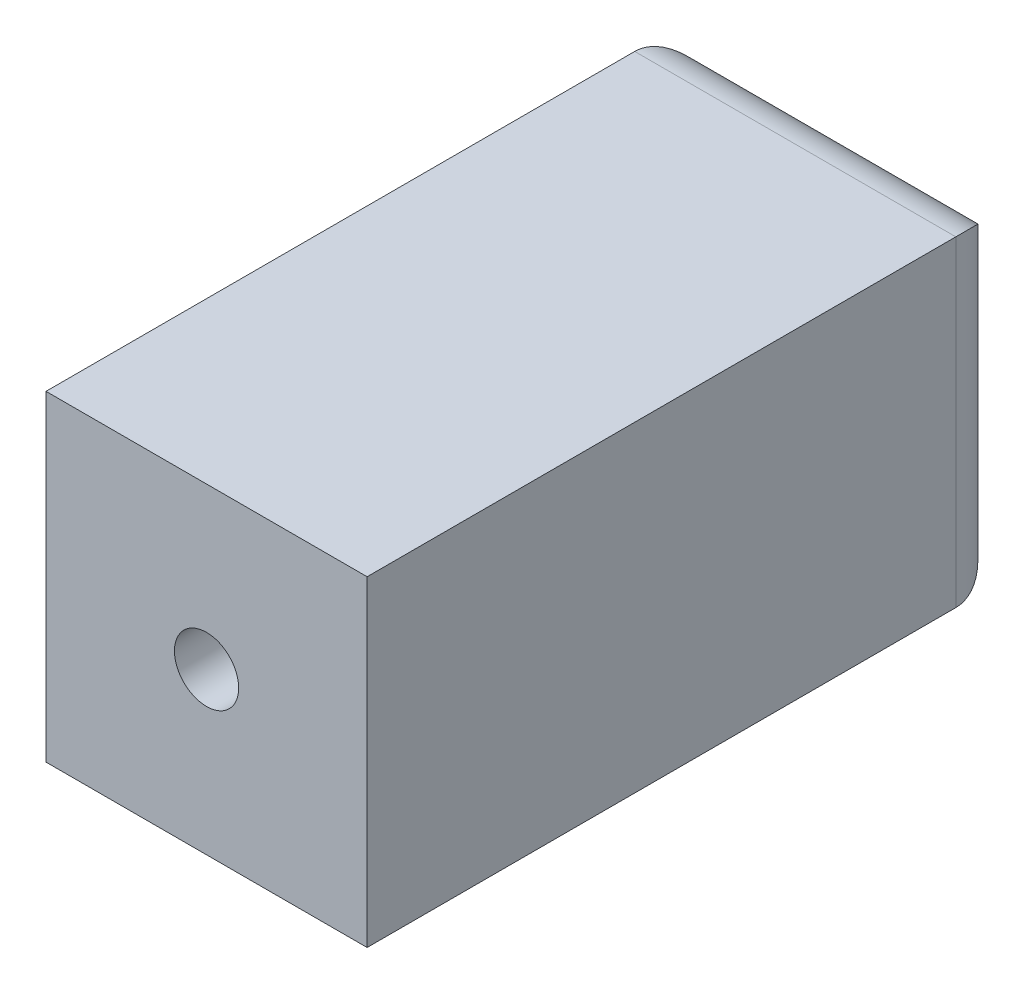
ISO-10303-21;
HEADER;
FILE_DESCRIPTION(('STEP AP214'),'2;1');
FILE_NAME('part.step','',(''),(''),'','','');
FILE_SCHEMA(('AUTOMOTIVE_DESIGN { 1 0 10303 214 1 1 1 1 }'));
ENDSEC;
DATA;
#1=APPLICATION_CONTEXT('core data for automotive mechanical design processes');
#2=APPLICATION_PROTOCOL_DEFINITION('international standard','automotive_design',2000,#1);
#3=PRODUCT_CONTEXT('',#1,'mechanical');
#4=PRODUCT('Part','Part','',(#3));
#5=PRODUCT_RELATED_PRODUCT_CATEGORY('part','',(#4));
#6=PRODUCT_DEFINITION_FORMATION('','',#4);
#7=PRODUCT_DEFINITION_CONTEXT('part definition',#1,'design');
#8=PRODUCT_DEFINITION('design','',#6,#7);
#9=PRODUCT_DEFINITION_SHAPE('','',#8);
#10=(LENGTH_UNIT() NAMED_UNIT(*) SI_UNIT(.MILLI.,.METRE.));
#11=(NAMED_UNIT(*) PLANE_ANGLE_UNIT() SI_UNIT($,.RADIAN.));
#12=(NAMED_UNIT(*) SI_UNIT($,.STERADIAN.) SOLID_ANGLE_UNIT());
#13=UNCERTAINTY_MEASURE_WITH_UNIT(LENGTH_MEASURE(1.E-05),#10,'distance_accuracy_value','');
#14=(GEOMETRIC_REPRESENTATION_CONTEXT(3) GLOBAL_UNCERTAINTY_ASSIGNED_CONTEXT((#13)) GLOBAL_UNIT_ASSIGNED_CONTEXT((#10,
#11,#12)) REPRESENTATION_CONTEXT('',''));
#15=CARTESIAN_POINT('',(0.,0.,0.));
#16=DIRECTION('',(0.,0.,1.));
#17=DIRECTION('',(1.,0.,0.));
#18=AXIS2_PLACEMENT_3D('',#15,#16,#17);
#19=CARTESIAN_POINT('',(7.5,7.5,0.));
#20=DIRECTION('',(0.,0.,-1.));
#21=DIRECTION('',(-1.,0.,0.));
#22=AXIS2_PLACEMENT_3D('',#19,#20,#21);
#23=CYLINDRICAL_SURFACE('',#22,1.49999999999999);
#24=CARTESIAN_POINT('',(7.5,7.5,30.));
#25=DIRECTION('',(0.,0.,-1.));
#26=DIRECTION('',(-1.,0.,0.));
#27=AXIS2_PLACEMENT_3D('',#24,#25,#26);
#28=CIRCLE('',#27,1.49999999999999);
#29=CARTESIAN_POINT('',(6.,7.5,30.));
#30=VERTEX_POINT('',#29);
#31=EDGE_CURVE('E134',#30,#30,#28,.T.);
#32=ORIENTED_EDGE('',*,*,#31,.F.);
#33=EDGE_LOOP('',(#32));
#34=FACE_BOUND('',#33,.T.);
#35=CARTESIAN_POINT('',(7.5,7.5,27.));
#36=DIRECTION('',(0.,0.,-1.));
#37=DIRECTION('',(-1.,0.,0.));
#38=AXIS2_PLACEMENT_3D('',#35,#36,#37);
#39=CIRCLE('',#38,1.49999999999999);
#40=CARTESIAN_POINT('',(6.00000000000001,7.5,27.));
#41=VERTEX_POINT('',#40);
#42=EDGE_CURVE('E39',#41,#41,#39,.F.);
#43=ORIENTED_EDGE('',*,*,#42,.F.);
#44=EDGE_LOOP('',(#43));
#45=FACE_BOUND('',#44,.T.);
#46=ADVANCED_FACE('F35',(#34,#45),#23,.F.);
#47=CARTESIAN_POINT('',(0.,0.,30.));
#48=DIRECTION('',(1.,0.,0.));
#49=DIRECTION('',(0.,1.,0.));
#50=AXIS2_PLACEMENT_3D('',#47,#48,#49);
#51=PLANE('',#50);
#52=DIRECTION('',(0.,0.,-1.));
#53=VECTOR('',#52,1.);
#54=CARTESIAN_POINT('',(0.,15.,30.));
#55=LINE('',#54,#53);
#56=CARTESIAN_POINT('',(0.,15.,30.));
#57=VERTEX_POINT('',#56);
#58=CARTESIAN_POINT('',(0.,15.,2.5));
#59=VERTEX_POINT('',#58);
#60=EDGE_CURVE('E158',#57,#59,#55,.T.);
#61=ORIENTED_EDGE('',*,*,#60,.T.);
#62=DIRECTION('',(0.,-1.,0.));
#63=VECTOR('',#62,1.);
#64=CARTESIAN_POINT('',(0.,0.,2.5));
#65=LINE('',#64,#63);
#66=CARTESIAN_POINT('',(0.,0.,2.5));
#67=VERTEX_POINT('',#66);
#68=EDGE_CURVE('E11',#59,#67,#65,.T.);
#69=ORIENTED_EDGE('',*,*,#68,.T.);
#70=DIRECTION('',(0.,0.,-1.));
#71=VECTOR('',#70,1.);
#72=CARTESIAN_POINT('',(0.,0.,30.));
#73=LINE('',#72,#71);
#74=CARTESIAN_POINT('',(0.,0.,30.));
#75=VERTEX_POINT('',#74);
#76=EDGE_CURVE('E96',#75,#67,#73,.T.);
#77=ORIENTED_EDGE('',*,*,#76,.F.);
#78=DIRECTION('',(0.,-1.,0.));
#79=VECTOR('',#78,1.);
#80=CARTESIAN_POINT('',(0.,0.,30.));
#81=LINE('',#80,#79);
#82=EDGE_CURVE('E102',#57,#75,#81,.T.);
#83=ORIENTED_EDGE('',*,*,#82,.F.);
#84=EDGE_LOOP('',(#61,#69,#77,#83));
#85=FACE_BOUND('',#84,.T.);
#86=ADVANCED_FACE('F111',(#85),#51,.F.);
#87=CARTESIAN_POINT('',(0.,0.,30.));
#88=DIRECTION('',(0.,1.,0.));
#89=DIRECTION('',(0.,0.,1.));
#90=AXIS2_PLACEMENT_3D('',#87,#88,#89);
#91=PLANE('',#90);
#92=ORIENTED_EDGE('',*,*,#76,.T.);
#93=DIRECTION('',(1.,0.,0.));
#94=VECTOR('',#93,1.);
#95=CARTESIAN_POINT('',(15.,0.,2.5));
#96=LINE('',#95,#94);
#97=CARTESIAN_POINT('',(15.,0.,2.5));
#98=VERTEX_POINT('',#97);
#99=EDGE_CURVE('E113',#67,#98,#96,.T.);
#100=ORIENTED_EDGE('',*,*,#99,.T.);
#101=DIRECTION('',(0.,0.,-1.));
#102=VECTOR('',#101,1.);
#103=CARTESIAN_POINT('',(15.,0.,30.));
#104=LINE('',#103,#102);
#105=CARTESIAN_POINT('',(15.,0.,30.));
#106=VERTEX_POINT('',#105);
#107=EDGE_CURVE('E98',#106,#98,#104,.T.);
#108=ORIENTED_EDGE('',*,*,#107,.F.);
#109=DIRECTION('',(1.,0.,0.));
#110=VECTOR('',#109,1.);
#111=CARTESIAN_POINT('',(0.,0.,30.));
#112=LINE('',#111,#110);
#113=EDGE_CURVE('E91',#75,#106,#112,.T.);
#114=ORIENTED_EDGE('',*,*,#113,.F.);
#115=EDGE_LOOP('',(#92,#100,#108,#114));
#116=FACE_BOUND('',#115,.T.);
#117=ADVANCED_FACE('F93',(#116),#91,.F.);
#118=CARTESIAN_POINT('',(15.,0.,30.));
#119=DIRECTION('',(-1.,0.,0.));
#120=DIRECTION('',(0.,-1.,0.));
#121=AXIS2_PLACEMENT_3D('',#118,#119,#120);
#122=PLANE('',#121);
#123=ORIENTED_EDGE('',*,*,#107,.T.);
#124=DIRECTION('',(0.,1.,0.));
#125=VECTOR('',#124,1.);
#126=CARTESIAN_POINT('',(15.,15.,2.5));
#127=LINE('',#126,#125);
#128=CARTESIAN_POINT('',(15.,15.,2.5));
#129=VERTEX_POINT('',#128);
#130=EDGE_CURVE('E59',#98,#129,#127,.T.);
#131=ORIENTED_EDGE('',*,*,#130,.T.);
#132=DIRECTION('',(0.,0.,-1.));
#133=VECTOR('',#132,1.);
#134=CARTESIAN_POINT('',(15.,15.,30.));
#135=LINE('',#134,#133);
#136=CARTESIAN_POINT('',(15.,15.,30.));
#137=VERTEX_POINT('',#136);
#138=EDGE_CURVE('E117',#137,#129,#135,.T.);
#139=ORIENTED_EDGE('',*,*,#138,.F.);
#140=DIRECTION('',(0.,1.,0.));
#141=VECTOR('',#140,1.);
#142=CARTESIAN_POINT('',(15.,0.,30.));
#143=LINE('',#142,#141);
#144=EDGE_CURVE('E101',#106,#137,#143,.T.);
#145=ORIENTED_EDGE('',*,*,#144,.F.);
#146=EDGE_LOOP('',(#123,#131,#139,#145));
#147=FACE_BOUND('',#146,.T.);
#148=ADVANCED_FACE('F156',(#147),#122,.F.);
#149=CARTESIAN_POINT('',(0.,15.,30.));
#150=DIRECTION('',(0.,-1.,0.));
#151=DIRECTION('',(0.,0.,-1.));
#152=AXIS2_PLACEMENT_3D('',#149,#150,#151);
#153=PLANE('',#152);
#154=ORIENTED_EDGE('',*,*,#138,.T.);
#155=DIRECTION('',(-1.,0.,0.));
#156=VECTOR('',#155,1.);
#157=CARTESIAN_POINT('',(0.,15.,2.5));
#158=LINE('',#157,#156);
#159=EDGE_CURVE('E44',#129,#59,#158,.T.);
#160=ORIENTED_EDGE('',*,*,#159,.T.);
#161=ORIENTED_EDGE('',*,*,#60,.F.);
#162=DIRECTION('',(-1.,0.,0.));
#163=VECTOR('',#162,1.);
#164=CARTESIAN_POINT('',(0.,15.,30.));
#165=LINE('',#164,#163);
#166=EDGE_CURVE('E107',#137,#57,#165,.T.);
#167=ORIENTED_EDGE('',*,*,#166,.F.);
#168=EDGE_LOOP('',(#154,#160,#161,#167));
#169=FACE_BOUND('',#168,.T.);
#170=ADVANCED_FACE('F161',(#169),#153,.F.);
#171=CARTESIAN_POINT('',(0.,0.,30.));
#172=DIRECTION('',(0.,0.,-1.));
#173=DIRECTION('',(-1.,0.,0.));
#174=AXIS2_PLACEMENT_3D('',#171,#172,#173);
#175=PLANE('',#174);
#176=ORIENTED_EDGE('',*,*,#31,.T.);
#177=EDGE_LOOP('',(#176));
#178=FACE_BOUND('',#177,.T.);
#179=ORIENTED_EDGE('',*,*,#82,.T.);
#180=ORIENTED_EDGE('',*,*,#113,.T.);
#181=ORIENTED_EDGE('',*,*,#144,.T.);
#182=ORIENTED_EDGE('',*,*,#166,.T.);
#183=EDGE_LOOP('',(#179,#180,#181,#182));
#184=FACE_BOUND('',#183,.T.);
#185=ADVANCED_FACE('F105',(#178,#184),#175,.F.);
#186=CARTESIAN_POINT('',(0.,0.,0.));
#187=DIRECTION('',(0.,0.,-1.));
#188=DIRECTION('',(-1.,0.,0.));
#189=AXIS2_PLACEMENT_3D('',#186,#187,#188);
#190=PLANE('',#189);
#191=CARTESIAN_POINT('',(7.5,7.5,0.));
#192=DIRECTION('',(0.,0.,-1.));
#193=DIRECTION('',(-1.,0.,0.));
#194=AXIS2_PLACEMENT_3D('',#191,#192,#193);
#195=CIRCLE('',#194,3.);
#196=CARTESIAN_POINT('',(4.5,7.5,0.));
#197=VERTEX_POINT('',#196);
#198=EDGE_CURVE('E191',#197,#197,#195,.T.);
#199=ORIENTED_EDGE('',*,*,#198,.F.);
#200=EDGE_LOOP('',(#199));
#201=FACE_BOUND('',#200,.T.);
#202=DIRECTION('',(0.,1.,0.));
#203=VECTOR('',#202,1.);
#204=CARTESIAN_POINT('',(12.5,0.,0.));
#205=LINE('',#204,#203);
#206=CARTESIAN_POINT('',(12.5,12.5,0.));
#207=VERTEX_POINT('',#206);
#208=CARTESIAN_POINT('',(12.5,2.5,0.));
#209=VERTEX_POINT('',#208);
#210=EDGE_CURVE('E124',#207,#209,#205,.F.);
#211=ORIENTED_EDGE('',*,*,#210,.T.);
#212=DIRECTION('',(1.,0.,0.));
#213=VECTOR('',#212,1.);
#214=CARTESIAN_POINT('',(0.,2.5,0.));
#215=LINE('',#214,#213);
#216=CARTESIAN_POINT('',(2.5,2.5,0.));
#217=VERTEX_POINT('',#216);
#218=EDGE_CURVE('E126',#209,#217,#215,.F.);
#219=ORIENTED_EDGE('',*,*,#218,.T.);
#220=DIRECTION('',(0.,-1.,0.));
#221=VECTOR('',#220,1.);
#222=CARTESIAN_POINT('',(2.5,15.,0.));
#223=LINE('',#222,#221);
#224=CARTESIAN_POINT('',(2.5,12.5,0.));
#225=VERTEX_POINT('',#224);
#226=EDGE_CURVE('E115',#217,#225,#223,.F.);
#227=ORIENTED_EDGE('',*,*,#226,.T.);
#228=DIRECTION('',(-1.,0.,0.));
#229=VECTOR('',#228,1.);
#230=CARTESIAN_POINT('',(15.,12.5,0.));
#231=LINE('',#230,#229);
#232=EDGE_CURVE('E122',#225,#207,#231,.F.);
#233=ORIENTED_EDGE('',*,*,#232,.T.);
#234=EDGE_LOOP('',(#211,#219,#227,#233));
#235=FACE_BOUND('',#234,.T.);
#236=ADVANCED_FACE('F148',(#201,#235),#190,.T.);
#237=CARTESIAN_POINT('',(0.,12.5,2.5));
#238=DIRECTION('',(1.,0.,0.));
#239=DIRECTION('',(0.,0.,-1.));
#240=AXIS2_PLACEMENT_3D('',#237,#238,#239);
#241=CYLINDRICAL_SURFACE('',#240,2.5);
#242=CARTESIAN_POINT('',(12.5,12.5,2.5));
#243=DIRECTION('',(0.707106781186548,-0.707106781186547,0.));
#244=DIRECTION('',(0.707106781186547,0.707106781186548,0.));
#245=AXIS2_PLACEMENT_3D('',#242,#243,#244);
#246=ELLIPSE('',#245,3.53553390593274,2.5);
#247=EDGE_CURVE('E136',#207,#129,#246,.T.);
#248=ORIENTED_EDGE('',*,*,#247,.F.);
#249=ORIENTED_EDGE('',*,*,#232,.F.);
#250=CARTESIAN_POINT('',(2.5,12.5,2.5));
#251=DIRECTION('',(0.707106781186547,0.707106781186548,0.));
#252=DIRECTION('',(-0.707106781186548,0.707106781186547,0.));
#253=AXIS2_PLACEMENT_3D('',#250,#251,#252);
#254=ELLIPSE('',#253,3.53553390593274,2.5);
#255=EDGE_CURVE('E109',#59,#225,#254,.F.);
#256=ORIENTED_EDGE('',*,*,#255,.F.);
#257=ORIENTED_EDGE('',*,*,#159,.F.);
#258=EDGE_LOOP('',(#248,#249,#256,#257));
#259=FACE_BOUND('',#258,.T.);
#260=ADVANCED_FACE('F37',(#259),#241,.T.);
#261=CARTESIAN_POINT('',(2.5,0.,2.5));
#262=DIRECTION('',(0.,1.,0.));
#263=DIRECTION('',(-1.,0.,0.));
#264=AXIS2_PLACEMENT_3D('',#261,#262,#263);
#265=CYLINDRICAL_SURFACE('',#264,2.5);
#266=ORIENTED_EDGE('',*,*,#255,.T.);
#267=ORIENTED_EDGE('',*,*,#226,.F.);
#268=CARTESIAN_POINT('',(2.5,2.5,2.5));
#269=DIRECTION('',(-0.707106781186548,0.707106781186547,0.));
#270=DIRECTION('',(0.707106781186547,0.707106781186548,0.));
#271=AXIS2_PLACEMENT_3D('',#268,#269,#270);
#272=ELLIPSE('',#271,3.53553390593274,2.5);
#273=EDGE_CURVE('E133',#67,#217,#272,.F.);
#274=ORIENTED_EDGE('',*,*,#273,.F.);
#275=ORIENTED_EDGE('',*,*,#68,.F.);
#276=EDGE_LOOP('',(#266,#267,#274,#275));
#277=FACE_BOUND('',#276,.T.);
#278=ADVANCED_FACE('F142',(#277),#265,.T.);
#279=CARTESIAN_POINT('',(12.5,0.,2.5));
#280=DIRECTION('',(0.,-1.,0.));
#281=DIRECTION('',(1.,0.,0.));
#282=AXIS2_PLACEMENT_3D('',#279,#280,#281);
#283=CYLINDRICAL_SURFACE('',#282,2.5);
#284=ORIENTED_EDGE('',*,*,#247,.T.);
#285=ORIENTED_EDGE('',*,*,#130,.F.);
#286=CARTESIAN_POINT('',(12.5,2.5,2.5));
#287=DIRECTION('',(-0.707106781186547,-0.707106781186548,0.));
#288=DIRECTION('',(0.707106781186548,-0.707106781186547,0.));
#289=AXIS2_PLACEMENT_3D('',#286,#287,#288);
#290=ELLIPSE('',#289,3.53553390593274,2.5);
#291=EDGE_CURVE('E131',#209,#98,#290,.T.);
#292=ORIENTED_EDGE('',*,*,#291,.F.);
#293=ORIENTED_EDGE('',*,*,#210,.F.);
#294=EDGE_LOOP('',(#284,#285,#292,#293));
#295=FACE_BOUND('',#294,.T.);
#296=ADVANCED_FACE('F155',(#295),#283,.T.);
#297=CARTESIAN_POINT('',(0.,2.5,2.5));
#298=DIRECTION('',(-1.,0.,0.));
#299=DIRECTION('',(0.,0.,1.));
#300=AXIS2_PLACEMENT_3D('',#297,#298,#299);
#301=CYLINDRICAL_SURFACE('',#300,2.5);
#302=ORIENTED_EDGE('',*,*,#273,.T.);
#303=ORIENTED_EDGE('',*,*,#218,.F.);
#304=ORIENTED_EDGE('',*,*,#291,.T.);
#305=ORIENTED_EDGE('',*,*,#99,.F.);
#306=EDGE_LOOP('',(#302,#303,#304,#305));
#307=FACE_BOUND('',#306,.T.);
#308=ADVANCED_FACE('F152',(#307),#301,.T.);
#309=CARTESIAN_POINT('',(7.5,7.5,27.));
#310=DIRECTION('',(0.,0.,-1.));
#311=DIRECTION('',(-1.,0.,0.));
#312=AXIS2_PLACEMENT_3D('',#309,#310,#311);
#313=PLANE('',#312);
#314=CARTESIAN_POINT('',(7.5,7.5,27.));
#315=DIRECTION('',(0.,0.,-1.));
#316=DIRECTION('',(-1.,0.,0.));
#317=AXIS2_PLACEMENT_3D('',#314,#315,#316);
#318=CIRCLE('',#317,3.);
#319=CARTESIAN_POINT('',(4.5,7.5,27.));
#320=VERTEX_POINT('',#319);
#321=EDGE_CURVE('E193',#320,#320,#318,.T.);
#322=ORIENTED_EDGE('',*,*,#321,.T.);
#323=EDGE_LOOP('',(#322));
#324=FACE_BOUND('',#323,.T.);
#325=ORIENTED_EDGE('',*,*,#42,.T.);
#326=EDGE_LOOP('',(#325));
#327=FACE_BOUND('',#326,.T.);
#328=ADVANCED_FACE('F202',(#324,#327),#313,.T.);
#329=CARTESIAN_POINT('',(7.5,7.5,27.));
#330=DIRECTION('',(0.,0.,-1.));
#331=DIRECTION('',(-1.,0.,0.));
#332=AXIS2_PLACEMENT_3D('',#329,#330,#331);
#333=CYLINDRICAL_SURFACE('',#332,3.);
#334=ORIENTED_EDGE('',*,*,#321,.F.);
#335=EDGE_LOOP('',(#334));
#336=FACE_BOUND('',#335,.T.);
#337=ORIENTED_EDGE('',*,*,#198,.T.);
#338=EDGE_LOOP('',(#337));
#339=FACE_BOUND('',#338,.T.);
#340=ADVANCED_FACE('F182',(#336,#339),#333,.F.);
#341=CLOSED_SHELL('',(#46,#86,#117,#148,#170,#185,#236,#260,#278,#296,#308,#328,#340));
#342=MANIFOLD_SOLID_BREP('B2',#341);
#343=ADVANCED_BREP_SHAPE_REPRESENTATION('',(#18,#342),#14);
#344=SHAPE_DEFINITION_REPRESENTATION(#9,#343);
ENDSEC;
END-ISO-10303-21;
